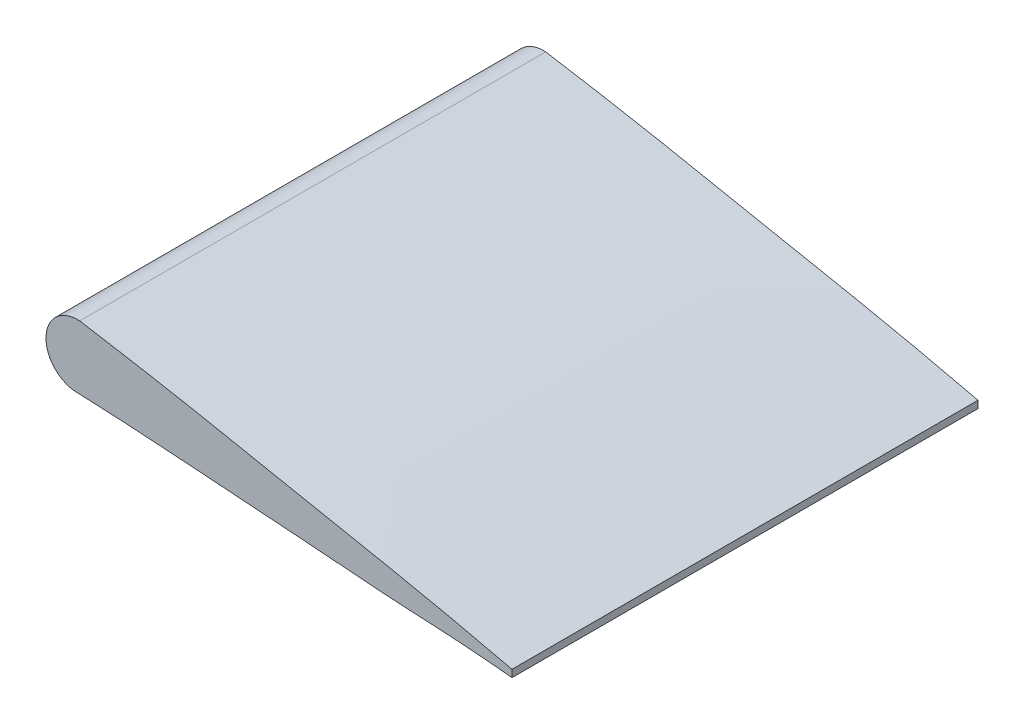
ISO-10303-21;
HEADER;
FILE_DESCRIPTION(('STEP AP214'),'2;1');
FILE_NAME('part.step','',(''),(''),'','','');
FILE_SCHEMA(('AUTOMOTIVE_DESIGN { 1 0 10303 214 1 1 1 1 }'));
ENDSEC;
DATA;
#1=APPLICATION_CONTEXT('core data for automotive mechanical design processes');
#2=APPLICATION_PROTOCOL_DEFINITION('international standard','automotive_design',2000,#1);
#3=PRODUCT_CONTEXT('',#1,'mechanical');
#4=PRODUCT('Part','Part','',(#3));
#5=PRODUCT_RELATED_PRODUCT_CATEGORY('part','',(#4));
#6=PRODUCT_DEFINITION_FORMATION('','',#4);
#7=PRODUCT_DEFINITION_CONTEXT('part definition',#1,'design');
#8=PRODUCT_DEFINITION('design','',#6,#7);
#9=PRODUCT_DEFINITION_SHAPE('','',#8);
#10=(LENGTH_UNIT() NAMED_UNIT(*) SI_UNIT(.MILLI.,.METRE.));
#11=(NAMED_UNIT(*) PLANE_ANGLE_UNIT() SI_UNIT($,.RADIAN.));
#12=(NAMED_UNIT(*) SI_UNIT($,.STERADIAN.) SOLID_ANGLE_UNIT());
#13=UNCERTAINTY_MEASURE_WITH_UNIT(LENGTH_MEASURE(1.E-05),#10,'distance_accuracy_value','');
#14=(GEOMETRIC_REPRESENTATION_CONTEXT(3) GLOBAL_UNCERTAINTY_ASSIGNED_CONTEXT((#13)) GLOBAL_UNIT_ASSIGNED_CONTEXT((#10,
#11,#12)) REPRESENTATION_CONTEXT('',''));
#15=CARTESIAN_POINT('',(0.,0.,0.));
#16=DIRECTION('',(0.,0.,1.));
#17=DIRECTION('',(1.,0.,0.));
#18=AXIS2_PLACEMENT_3D('',#15,#16,#17);
#19=CARTESIAN_POINT('',(254.,0.,114.3));
#20=DIRECTION('',(1.,0.,0.));
#21=DIRECTION('',(0.,0.,-1.));
#22=AXIS2_PLACEMENT_3D('',#19,#20,#21);
#23=PLANE('',#22);
#24=DIRECTION('',(0.,-1.,0.));
#25=VECTOR('',#24,1.);
#26=CARTESIAN_POINT('',(254.,0.,0.));
#27=LINE('',#26,#25);
#28=CARTESIAN_POINT('',(254.,0.889,0.));
#29=VERTEX_POINT('',#28);
#30=CARTESIAN_POINT('',(254.,-0.889,0.));
#31=VERTEX_POINT('',#30);
#32=EDGE_CURVE('E108',#29,#31,#27,.T.);
#33=ORIENTED_EDGE('',*,*,#32,.F.);
#34=DIRECTION('',(0.,0.,-1.));
#35=VECTOR('',#34,1.);
#36=CARTESIAN_POINT('',(254.,0.889,114.3));
#37=LINE('',#36,#35);
#38=CARTESIAN_POINT('',(254.,0.889,114.3));
#39=VERTEX_POINT('',#38);
#40=EDGE_CURVE('E11',#39,#29,#37,.T.);
#41=ORIENTED_EDGE('',*,*,#40,.F.);
#42=DIRECTION('',(0.,-1.,0.));
#43=VECTOR('',#42,1.);
#44=CARTESIAN_POINT('',(254.,0.,114.3));
#45=LINE('',#44,#43);
#46=CARTESIAN_POINT('',(254.,-0.889,114.3));
#47=VERTEX_POINT('',#46);
#48=EDGE_CURVE('E91',#39,#47,#45,.T.);
#49=ORIENTED_EDGE('',*,*,#48,.T.);
#50=DIRECTION('',(0.,0.,-1.));
#51=VECTOR('',#50,1.);
#52=CARTESIAN_POINT('',(254.,-0.889,114.3));
#53=LINE('',#52,#51);
#54=EDGE_CURVE('E81',#47,#31,#53,.T.);
#55=ORIENTED_EDGE('',*,*,#54,.T.);
#56=EDGE_LOOP('',(#33,#41,#49,#55));
#57=FACE_BOUND('',#56,.T.);
#58=ADVANCED_FACE('F43',(#57),#23,.T.);
#59=CARTESIAN_POINT('',(254.,0.889,114.3));
#60=CARTESIAN_POINT('',(249.755300970815,1.87859335879138,114.3));
#61=CARTESIAN_POINT('',(241.284220880923,3.85350949327115,114.3));
#62=CARTESIAN_POINT('',(224.315824878738,7.47360796274141,114.3));
#63=CARTESIAN_POINT('',(203.05645214663,11.527247875921,114.3));
#64=CARTESIAN_POINT('',(177.661285298347,16.7283151711408,114.3));
#65=CARTESIAN_POINT('',(152.225299570029,21.2845866773474,114.3));
#66=CARTESIAN_POINT('',(126.828421648593,25.2079785656243,114.3));
#67=CARTESIAN_POINT('',(101.333206340152,27.1528883192298,114.3));
#68=CARTESIAN_POINT('',(75.8855775698564,27.1773494799594,114.3));
#69=CARTESIAN_POINT('',(54.6410711732149,26.1944719622386,114.3));
#70=CARTESIAN_POINT('',(37.7241163214368,23.4783326302527,114.3));
#71=CARTESIAN_POINT('',(27.1417884701442,20.8628241390568,114.3));
#72=CARTESIAN_POINT('',(18.7017015238388,17.8363751494572,114.3));
#73=CARTESIAN_POINT('',(12.2245669579805,14.7192309641996,114.3));
#74=CARTESIAN_POINT('',(6.86434226787735,10.8535428339271,114.3));
#75=CARTESIAN_POINT('',(2.51235855602438,6.22581458658149,114.3));
#76=CARTESIAN_POINT('',(-1.73290163626524,0.897528071081177,114.3));
#77=CARTESIAN_POINT('',(2.55713928637989,-4.25701737593825,114.3));
#78=CARTESIAN_POINT('',(7.56240835156454,-3.187950948253,114.3));
#79=CARTESIAN_POINT('',(12.6981755886411,-1.97881196697224,114.3));
#80=CARTESIAN_POINT('',(19.0497788713052,-0.425917760205466,114.3));
#81=CARTESIAN_POINT('',(27.4331723433081,1.48652075883262,114.3));
#82=CARTESIAN_POINT('',(38.055130020046,2.87246029503792,114.3));
#83=CARTESIAN_POINT('',(54.9248511737947,5.06353567073955,114.3));
#84=CARTESIAN_POINT('',(76.1187279823022,6.22695218699561,114.3));
#85=CARTESIAN_POINT('',(101.511907223727,7.47215019118125,114.3));
#86=CARTESIAN_POINT('',(126.928831839546,6.95185663813201,114.3));
#87=CARTESIAN_POINT('',(152.35396728999,6.3243740525819,114.3));
#88=CARTESIAN_POINT('',(177.75502548679,4.53400447741137,114.3));
#89=CARTESIAN_POINT('',(203.173260156956,2.78508361262511,114.3));
#90=CARTESIAN_POINT('',(224.335303209527,1.01678746856236,114.3));
#91=CARTESIAN_POINT('',(241.313406146471,0.326551109011815,114.3));
#92=CARTESIAN_POINT('',(249.76853137359,-0.483566796969676,114.3));
#93=CARTESIAN_POINT('',(254.,-0.889,114.3));
#94=B_SPLINE_CURVE_WITH_KNOTS('',3,(#59,#60,#61,#62,#63,#64,#65,#66,#67,#68,#69,#70,#71,#72,#73,
#74,#75,#76,#77,#78,#79,#80,#81,#82,#83,#84,#85,#86,#87,#88,#89,#90,#91,#92,#93),.UNSPECIFIED.,
.F.,.F.,(4,1,1,1,1,1,1,1,1,1,1,1,1,1,1,1,1,1,1,1,1,1,1,1,1,1,1,1,1,1,1,1,4),(0.,
0.0250449926618631,0.0499819038359856,0.0996928768778378,0.149404795317062,0.198930977090374,
0.248177786536747,0.297011091751789,0.345668691545482,0.394384356967894,0.418981924979963,
0.444018058552479,0.456912725617499,0.470404889353766,0.485361367241275,0.494028905478234,
0.508284261990904,0.517561661069311,0.523649237949193,0.536104636845839,0.548578769024395,
0.561002028831032,0.585561942244513,0.610032722389853,0.658766283263026,0.707434665540439,
0.756093744160532,0.804784589183796,0.853570641090438,0.902385984381083,0.951201327671728,
0.975578120321006,1.),.UNSPECIFIED.);
#95=DIRECTION('',(0.,0.,-1.));
#96=VECTOR('',#95,1.);
#97=SURFACE_OF_LINEAR_EXTRUSION('',#94,#96);
#98=CARTESIAN_POINT('',(254.,0.889,0.));
#99=CARTESIAN_POINT('',(249.755300970815,1.87859335879138,0.));
#100=CARTESIAN_POINT('',(241.284220880923,3.85350949327115,0.));
#101=CARTESIAN_POINT('',(224.315824878738,7.47360796274141,0.));
#102=CARTESIAN_POINT('',(203.05645214663,11.527247875921,0.));
#103=CARTESIAN_POINT('',(177.661285298347,16.7283151711408,0.));
#104=CARTESIAN_POINT('',(152.225299570029,21.2845866773474,0.));
#105=CARTESIAN_POINT('',(126.828421648593,25.2079785656243,0.));
#106=CARTESIAN_POINT('',(101.333206340152,27.1528883192298,0.));
#107=CARTESIAN_POINT('',(75.8855775698564,27.1773494799594,0.));
#108=CARTESIAN_POINT('',(54.6410711732149,26.1944719622386,0.));
#109=CARTESIAN_POINT('',(37.7241163214368,23.4783326302527,0.));
#110=CARTESIAN_POINT('',(27.1417884701442,20.8628241390568,0.));
#111=CARTESIAN_POINT('',(18.7017015238388,17.8363751494572,0.));
#112=CARTESIAN_POINT('',(12.2245669579805,14.7192309641996,0.));
#113=CARTESIAN_POINT('',(6.86434226787735,10.8535428339271,0.));
#114=CARTESIAN_POINT('',(2.51235855602438,6.22581458658149,0.));
#115=CARTESIAN_POINT('',(-1.73290163626524,0.897528071081177,0.));
#116=CARTESIAN_POINT('',(2.55713928637989,-4.25701737593825,0.));
#117=CARTESIAN_POINT('',(7.56240835156454,-3.187950948253,0.));
#118=CARTESIAN_POINT('',(12.6981755886411,-1.97881196697224,0.));
#119=CARTESIAN_POINT('',(19.0497788713052,-0.425917760205466,0.));
#120=CARTESIAN_POINT('',(27.4331723433081,1.48652075883262,0.));
#121=CARTESIAN_POINT('',(38.055130020046,2.87246029503792,0.));
#122=CARTESIAN_POINT('',(54.9248511737947,5.06353567073955,0.));
#123=CARTESIAN_POINT('',(76.1187279823022,6.22695218699561,0.));
#124=CARTESIAN_POINT('',(101.511907223727,7.47215019118125,0.));
#125=CARTESIAN_POINT('',(126.928831839546,6.95185663813201,0.));
#126=CARTESIAN_POINT('',(152.35396728999,6.3243740525819,0.));
#127=CARTESIAN_POINT('',(177.75502548679,4.53400447741137,0.));
#128=CARTESIAN_POINT('',(203.173260156956,2.78508361262511,0.));
#129=CARTESIAN_POINT('',(224.335303209527,1.01678746856236,0.));
#130=CARTESIAN_POINT('',(241.313406146471,0.326551109011815,0.));
#131=CARTESIAN_POINT('',(249.76853137359,-0.483566796969676,0.));
#132=CARTESIAN_POINT('',(254.,-0.889,0.));
#133=B_SPLINE_CURVE_WITH_KNOTS('',3,(#98,#99,#100,#101,#102,#103,#104,#105,#106,#107,#108,#109,
#110,#111,#112,#113,#114,#115,#116,#117,#118,#119,#120,#121,#122,#123,#124,#125,#126,#127,#128,
#129,#130,#131,#132),.UNSPECIFIED.,.F.,.F.,(4,1,1,1,1,1,1,1,1,1,1,1,1,1,1,1,1,1,1,1,1,1,1,1,1,1,
1,1,1,1,1,1,4),(0.,0.0250449926618631,0.0499819038359856,0.0996928768778378,0.149404795317062,
0.198930977090374,0.248177786536747,0.297011091751789,0.345668691545482,0.394384356967894,
0.418981924979963,0.444018058552479,0.456912725617499,0.470404889353766,0.485361367241275,
0.494028905478234,0.508284261990904,0.517561661069311,0.523649237949193,0.536104636845839,
0.548578769024395,0.561002028831032,0.585561942244513,0.610032722389853,0.658766283263026,
0.707434665540439,0.756093744160532,0.804784589183796,0.853570641090438,0.902385984381083,
0.951201327671728,0.975578120321006,1.),.UNSPECIFIED.);
#134=CARTESIAN_POINT('',(147.977859999576,21.8788454131846,0.));
#135=VERTEX_POINT('',#134);
#136=EDGE_CURVE('E97',#29,#135,#133,.T.);
#137=ORIENTED_EDGE('',*,*,#136,.T.);
#138=DIRECTION('',(0.,0.,-1.));
#139=VECTOR('',#138,1.);
#140=CARTESIAN_POINT('',(147.977859999576,21.8788454131846,114.3));
#141=LINE('',#140,#139);
#142=CARTESIAN_POINT('',(147.977859999576,21.8788454131846,114.3));
#143=VERTEX_POINT('',#142);
#144=EDGE_CURVE('E51',#143,#135,#141,.T.);
#145=ORIENTED_EDGE('',*,*,#144,.F.);
#146=EDGE_CURVE('E86',#39,#143,#94,.T.);
#147=ORIENTED_EDGE('',*,*,#146,.F.);
#148=ORIENTED_EDGE('',*,*,#40,.T.);
#149=EDGE_LOOP('',(#137,#145,#147,#148));
#150=FACE_BOUND('',#149,.T.);
#151=ADVANCED_FACE('F95',(#150),#97,.F.);
#152=CARTESIAN_POINT('',(147.493385519738,14.1005331066716,114.3));
#153=DIRECTION('',(0.,0.,-1.));
#154=DIRECTION('',(-1.,0.,0.));
#155=AXIS2_PLACEMENT_3D('',#152,#153,#154);
#156=CYLINDRICAL_SURFACE('',#155,7.79338551973825);
#157=CARTESIAN_POINT('',(147.493385519738,14.1005331066716,0.));
#158=DIRECTION('',(0.,0.,1.));
#159=DIRECTION('',(1.,0.,0.));
#160=AXIS2_PLACEMENT_3D('',#157,#158,#159);
#161=CIRCLE('',#160,7.79338551973825);
#162=CARTESIAN_POINT('',(146.402491493438,6.38387527554758,0.));
#163=VERTEX_POINT('',#162);
#164=EDGE_CURVE('E114',#163,#135,#161,.F.);
#165=ORIENTED_EDGE('',*,*,#164,.F.);
#166=DIRECTION('',(0.,0.,-1.));
#167=VECTOR('',#166,1.);
#168=CARTESIAN_POINT('',(146.402491493438,6.38387527554758,114.3));
#169=LINE('',#168,#167);
#170=CARTESIAN_POINT('',(146.402491493438,6.38387527554758,114.3));
#171=VERTEX_POINT('',#170);
#172=EDGE_CURVE('E74',#171,#163,#169,.T.);
#173=ORIENTED_EDGE('',*,*,#172,.F.);
#174=CARTESIAN_POINT('',(147.493385519738,14.1005331066716,114.3));
#175=DIRECTION('',(0.,0.,1.));
#176=DIRECTION('',(1.,0.,0.));
#177=AXIS2_PLACEMENT_3D('',#174,#175,#176);
#178=CIRCLE('',#177,7.79338551973825);
#179=EDGE_CURVE('E90',#171,#143,#178,.F.);
#180=ORIENTED_EDGE('',*,*,#179,.T.);
#181=ORIENTED_EDGE('',*,*,#144,.T.);
#182=EDGE_LOOP('',(#165,#173,#180,#181));
#183=FACE_BOUND('',#182,.T.);
#184=ADVANCED_FACE('F101',(#183),#156,.T.);
#185=EDGE_CURVE('E115',#163,#31,#133,.T.);
#186=ORIENTED_EDGE('',*,*,#185,.T.);
#187=ORIENTED_EDGE('',*,*,#54,.F.);
#188=EDGE_CURVE('E59',#171,#47,#94,.T.);
#189=ORIENTED_EDGE('',*,*,#188,.F.);
#190=ORIENTED_EDGE('',*,*,#172,.T.);
#191=EDGE_LOOP('',(#186,#187,#189,#190));
#192=FACE_BOUND('',#191,.T.);
#193=ADVANCED_FACE('F127',(#192),#97,.F.);
#194=CARTESIAN_POINT('',(0.,0.,114.3));
#195=DIRECTION('',(0.,0.,1.));
#196=DIRECTION('',(1.,0.,0.));
#197=AXIS2_PLACEMENT_3D('',#194,#195,#196);
#198=PLANE('',#197);
#199=ORIENTED_EDGE('',*,*,#48,.F.);
#200=ORIENTED_EDGE('',*,*,#146,.T.);
#201=ORIENTED_EDGE('',*,*,#179,.F.);
#202=ORIENTED_EDGE('',*,*,#188,.T.);
#203=EDGE_LOOP('',(#199,#200,#201,#202));
#204=FACE_BOUND('',#203,.T.);
#205=ADVANCED_FACE('F88',(#204),#198,.T.);
#206=CARTESIAN_POINT('',(0.,0.,0.));
#207=DIRECTION('',(0.,0.,1.));
#208=DIRECTION('',(1.,0.,0.));
#209=AXIS2_PLACEMENT_3D('',#206,#207,#208);
#210=PLANE('',#209);
#211=ORIENTED_EDGE('',*,*,#32,.T.);
#212=ORIENTED_EDGE('',*,*,#185,.F.);
#213=ORIENTED_EDGE('',*,*,#164,.T.);
#214=ORIENTED_EDGE('',*,*,#136,.F.);
#215=EDGE_LOOP('',(#211,#212,#213,#214));
#216=FACE_BOUND('',#215,.T.);
#217=ADVANCED_FACE('F136',(#216),#210,.F.);
#218=CLOSED_SHELL('',(#58,#151,#184,#193,#205,#217));
#219=MANIFOLD_SOLID_BREP('B2',#218);
#220=ADVANCED_BREP_SHAPE_REPRESENTATION('',(#18,#219),#14);
#221=SHAPE_DEFINITION_REPRESENTATION(#9,#220);
ENDSEC;
END-ISO-10303-21;
